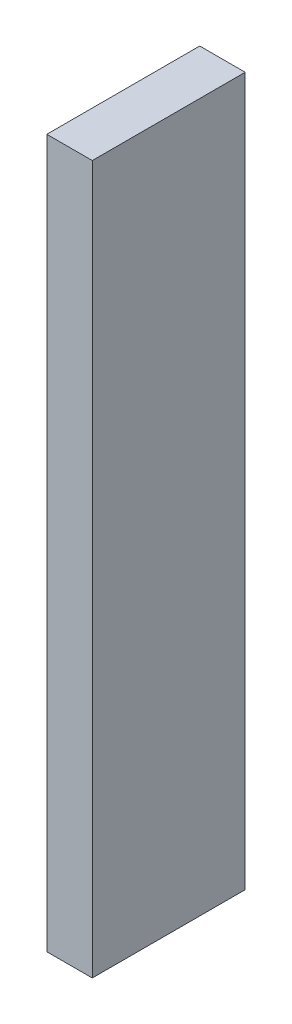
ISO-10303-21;
HEADER;
FILE_DESCRIPTION(('STEP AP214'),'2;1');
FILE_NAME('part.step','',(''),(''),'','','');
FILE_SCHEMA(('AUTOMOTIVE_DESIGN { 1 0 10303 214 1 1 1 1 }'));
ENDSEC;
DATA;
#1=APPLICATION_CONTEXT('core data for automotive mechanical design processes');
#2=APPLICATION_PROTOCOL_DEFINITION('international standard','automotive_design',2000,#1);
#3=PRODUCT_CONTEXT('',#1,'mechanical');
#4=PRODUCT('Part','Part','',(#3));
#5=PRODUCT_RELATED_PRODUCT_CATEGORY('part','',(#4));
#6=PRODUCT_DEFINITION_FORMATION('','',#4);
#7=PRODUCT_DEFINITION_CONTEXT('part definition',#1,'design');
#8=PRODUCT_DEFINITION('design','',#6,#7);
#9=PRODUCT_DEFINITION_SHAPE('','',#8);
#10=(LENGTH_UNIT() NAMED_UNIT(*) SI_UNIT(.MILLI.,.METRE.));
#11=(NAMED_UNIT(*) PLANE_ANGLE_UNIT() SI_UNIT($,.RADIAN.));
#12=(NAMED_UNIT(*) SI_UNIT($,.STERADIAN.) SOLID_ANGLE_UNIT());
#13=UNCERTAINTY_MEASURE_WITH_UNIT(LENGTH_MEASURE(1.E-05),#10,'distance_accuracy_value','');
#14=(GEOMETRIC_REPRESENTATION_CONTEXT(3) GLOBAL_UNCERTAINTY_ASSIGNED_CONTEXT((#13)) GLOBAL_UNIT_ASSIGNED_CONTEXT((#10,
#11,#12)) REPRESENTATION_CONTEXT('',''));
#15=CARTESIAN_POINT('',(0.,0.,0.));
#16=DIRECTION('',(0.,0.,1.));
#17=DIRECTION('',(1.,0.,0.));
#18=AXIS2_PLACEMENT_3D('',#15,#16,#17);
#19=CARTESIAN_POINT('',(130.275545237866,22.4180708263693,71.0720282028969));
#20=DIRECTION('',(-1.69244514382854E-09,0.,1.));
#21=DIRECTION('',(1.,0.,1.69244514382854E-09));
#22=AXIS2_PLACEMENT_3D('',#19,#20,#21);
#23=PLANE('',#22);
#24=DIRECTION('',(0.,-1.,0.));
#25=VECTOR('',#24,1.);
#26=CARTESIAN_POINT('',(131.258630334879,22.4180708263693,71.0720282045608));
#27=LINE('',#26,#25);
#28=CARTESIAN_POINT('',(131.258630334879,22.4180708263693,71.0720282045608));
#29=VERTEX_POINT('',#28);
#30=CARTESIAN_POINT('',(131.258630334879,7.11212965552236,71.0720282045608));
#31=VERTEX_POINT('',#30);
#32=EDGE_CURVE('E79',#29,#31,#27,.T.);
#33=ORIENTED_EDGE('',*,*,#32,.F.);
#34=DIRECTION('',(1.,0.,1.69244514382854E-09));
#35=VECTOR('',#34,1.);
#36=CARTESIAN_POINT('',(130.275545237866,22.4180708263693,71.0720282028969));
#37=LINE('',#36,#35);
#38=CARTESIAN_POINT('',(130.275545237866,22.4180708263693,71.0720282028969));
#39=VERTEX_POINT('',#38);
#40=EDGE_CURVE('E32',#39,#29,#37,.T.);
#41=ORIENTED_EDGE('',*,*,#40,.F.);
#42=DIRECTION('',(0.,-1.,0.));
#43=VECTOR('',#42,1.);
#44=CARTESIAN_POINT('',(130.275545237866,22.4180708263693,71.0720282028969));
#45=LINE('',#44,#43);
#46=CARTESIAN_POINT('',(130.275545237866,7.11212965552236,71.0720282028969));
#47=VERTEX_POINT('',#46);
#48=EDGE_CURVE('E71',#39,#47,#45,.T.);
#49=ORIENTED_EDGE('',*,*,#48,.T.);
#50=DIRECTION('',(1.,0.,1.69244514382854E-09));
#51=VECTOR('',#50,1.);
#52=CARTESIAN_POINT('',(130.275545237866,7.11212965552236,71.0720282028969));
#53=LINE('',#52,#51);
#54=EDGE_CURVE('E10',#47,#31,#53,.T.);
#55=ORIENTED_EDGE('',*,*,#54,.T.);
#56=EDGE_LOOP('',(#33,#41,#49,#55));
#57=FACE_BOUND('',#56,.T.);
#58=ADVANCED_FACE('F16',(#57),#23,.T.);
#59=CARTESIAN_POINT('',(130.275545237866,7.11212965552236,71.0720282028969));
#60=DIRECTION('',(0.,-1.,0.));
#61=DIRECTION('',(0.,0.,-1.));
#62=AXIS2_PLACEMENT_3D('',#59,#60,#61);
#63=PLANE('',#62);
#64=DIRECTION('',(1.69244514382854E-09,0.,-1.));
#65=VECTOR('',#64,1.);
#66=CARTESIAN_POINT('',(131.258630334879,7.11212965552236,71.0720282045608));
#67=LINE('',#66,#65);
#68=CARTESIAN_POINT('',(131.258630340474,7.11212965552235,67.766087033712));
#69=VERTEX_POINT('',#68);
#70=EDGE_CURVE('E82',#31,#69,#67,.T.);
#71=ORIENTED_EDGE('',*,*,#70,.F.);
#72=ORIENTED_EDGE('',*,*,#54,.F.);
#73=DIRECTION('',(1.69244514382854E-09,0.,-1.));
#74=VECTOR('',#73,1.);
#75=CARTESIAN_POINT('',(130.275545237866,7.11212965552236,71.0720282028969));
#76=LINE('',#75,#74);
#77=CARTESIAN_POINT('',(130.275545243461,7.11212965552235,67.7660870320482));
#78=VERTEX_POINT('',#77);
#79=EDGE_CURVE('E67',#47,#78,#76,.T.);
#80=ORIENTED_EDGE('',*,*,#79,.T.);
#81=DIRECTION('',(1.,0.,1.69244514382854E-09));
#82=VECTOR('',#81,1.);
#83=CARTESIAN_POINT('',(130.275545243461,7.11212965552235,67.7660870320482));
#84=LINE('',#83,#82);
#85=EDGE_CURVE('E24',#78,#69,#84,.T.);
#86=ORIENTED_EDGE('',*,*,#85,.T.);
#87=EDGE_LOOP('',(#71,#72,#80,#86));
#88=FACE_BOUND('',#87,.T.);
#89=ADVANCED_FACE('F68',(#88),#63,.T.);
#90=CARTESIAN_POINT('',(130.275545243461,7.11212965552235,67.7660870320482));
#91=DIRECTION('',(1.69244514382854E-09,0.,-1.));
#92=DIRECTION('',(-1.,0.,-1.69244514382854E-09));
#93=AXIS2_PLACEMENT_3D('',#90,#91,#92);
#94=PLANE('',#93);
#95=DIRECTION('',(0.,1.,0.));
#96=VECTOR('',#95,1.);
#97=CARTESIAN_POINT('',(131.258630340474,7.11212965552235,67.766087033712));
#98=LINE('',#97,#96);
#99=CARTESIAN_POINT('',(131.258630340474,22.418070826371,67.7660870252515));
#100=VERTEX_POINT('',#99);
#101=EDGE_CURVE('E65',#69,#100,#98,.T.);
#102=ORIENTED_EDGE('',*,*,#101,.F.);
#103=ORIENTED_EDGE('',*,*,#85,.F.);
#104=DIRECTION('',(0.,1.,0.));
#105=VECTOR('',#104,1.);
#106=CARTESIAN_POINT('',(130.275545243461,7.11212965552235,67.7660870320482));
#107=LINE('',#106,#105);
#108=CARTESIAN_POINT('',(130.275545243461,22.418070826371,67.7660870235876));
#109=VERTEX_POINT('',#108);
#110=EDGE_CURVE('E62',#78,#109,#107,.T.);
#111=ORIENTED_EDGE('',*,*,#110,.T.);
#112=DIRECTION('',(1.,0.,1.69244514382854E-09));
#113=VECTOR('',#112,1.);
#114=CARTESIAN_POINT('',(130.275545243461,22.418070826371,67.7660870235876));
#115=LINE('',#114,#113);
#116=EDGE_CURVE('E48',#109,#100,#115,.T.);
#117=ORIENTED_EDGE('',*,*,#116,.T.);
#118=EDGE_LOOP('',(#102,#103,#111,#117));
#119=FACE_BOUND('',#118,.T.);
#120=ADVANCED_FACE('F60',(#119),#94,.T.);
#121=CARTESIAN_POINT('',(130.275545243461,22.418070826371,67.7660870235876));
#122=DIRECTION('',(0.,1.,0.));
#123=DIRECTION('',(-1.,0.,0.));
#124=AXIS2_PLACEMENT_3D('',#121,#122,#123);
#125=PLANE('',#124);
#126=DIRECTION('',(-1.69244514382854E-09,0.,1.));
#127=VECTOR('',#126,1.);
#128=CARTESIAN_POINT('',(131.258630340474,22.418070826371,67.7660870252515));
#129=LINE('',#128,#127);
#130=EDGE_CURVE('E85',#100,#29,#129,.T.);
#131=ORIENTED_EDGE('',*,*,#130,.F.);
#132=ORIENTED_EDGE('',*,*,#116,.F.);
#133=DIRECTION('',(-1.69244514382854E-09,0.,1.));
#134=VECTOR('',#133,1.);
#135=CARTESIAN_POINT('',(130.275545243461,22.418070826371,67.7660870235876));
#136=LINE('',#135,#134);
#137=EDGE_CURVE('E74',#109,#39,#136,.T.);
#138=ORIENTED_EDGE('',*,*,#137,.T.);
#139=ORIENTED_EDGE('',*,*,#40,.T.);
#140=EDGE_LOOP('',(#131,#132,#138,#139));
#141=FACE_BOUND('',#140,.T.);
#142=ADVANCED_FACE('F96',(#141),#125,.T.);
#143=CARTESIAN_POINT('',(130.275545201028,17.2651002409467,92.8378644340291));
#144=DIRECTION('',(1.,0.,1.69244514382854E-09));
#145=DIRECTION('',(0.,1.,0.));
#146=AXIS2_PLACEMENT_3D('',#143,#144,#145);
#147=PLANE('',#146);
#148=ORIENTED_EDGE('',*,*,#48,.F.);
#149=ORIENTED_EDGE('',*,*,#137,.F.);
#150=ORIENTED_EDGE('',*,*,#110,.F.);
#151=ORIENTED_EDGE('',*,*,#79,.F.);
#152=EDGE_LOOP('',(#148,#149,#150,#151));
#153=FACE_BOUND('',#152,.T.);
#154=ADVANCED_FACE('F73',(#153),#147,.F.);
#155=CARTESIAN_POINT('',(131.258630298041,17.2651002409467,92.8378644356929));
#156=DIRECTION('',(1.,0.,1.69244514382854E-09));
#157=DIRECTION('',(0.,1.,0.));
#158=AXIS2_PLACEMENT_3D('',#155,#156,#157);
#159=PLANE('',#158);
#160=ORIENTED_EDGE('',*,*,#32,.T.);
#161=ORIENTED_EDGE('',*,*,#70,.T.);
#162=ORIENTED_EDGE('',*,*,#101,.T.);
#163=ORIENTED_EDGE('',*,*,#130,.T.);
#164=EDGE_LOOP('',(#160,#161,#162,#163));
#165=FACE_BOUND('',#164,.T.);
#166=ADVANCED_FACE('F89',(#165),#159,.T.);
#167=CLOSED_SHELL('',(#58,#89,#120,#142,#154,#166));
#168=MANIFOLD_SOLID_BREP('B1',#167);
#169=ADVANCED_BREP_SHAPE_REPRESENTATION('',(#18,#168),#14);
#170=SHAPE_DEFINITION_REPRESENTATION(#9,#169);
ENDSEC;
END-ISO-10303-21;
